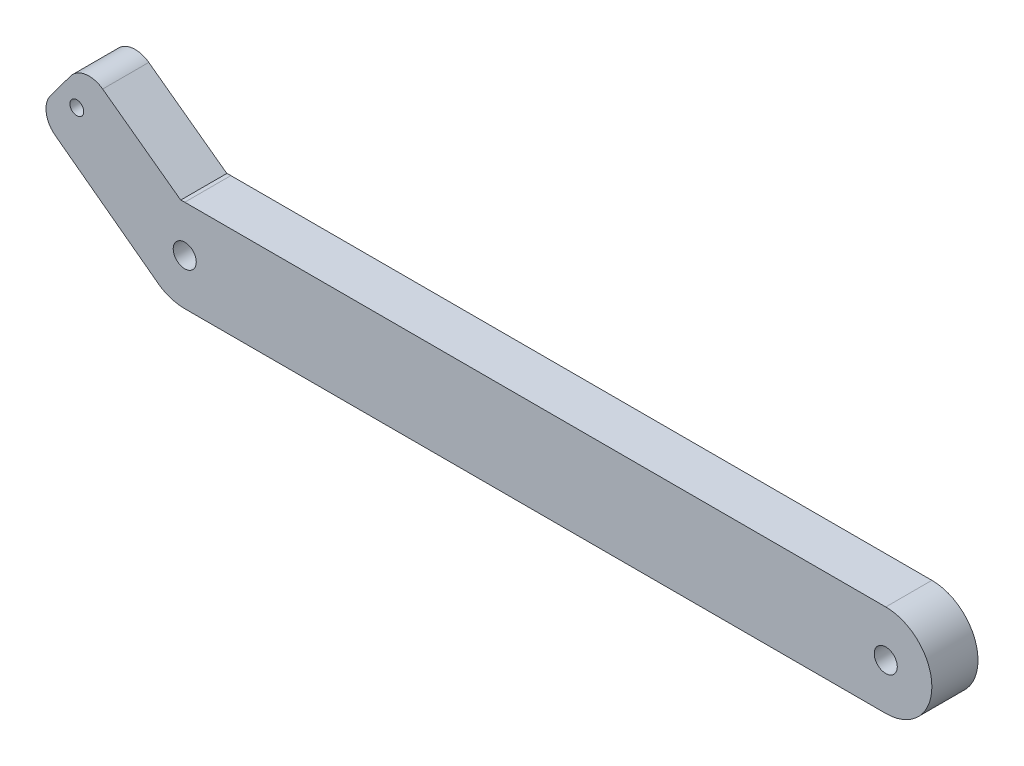
ISO-10303-21;
HEADER;
FILE_DESCRIPTION(('STEP AP214'),'2;1');
FILE_NAME('part.step','',(''),(''),'','','');
FILE_SCHEMA(('AUTOMOTIVE_DESIGN { 1 0 10303 214 1 1 1 1 }'));
ENDSEC;
DATA;
#1=APPLICATION_CONTEXT('core data for automotive mechanical design processes');
#2=APPLICATION_PROTOCOL_DEFINITION('international standard','automotive_design',2000,#1);
#3=PRODUCT_CONTEXT('',#1,'mechanical');
#4=PRODUCT('Part','Part','',(#3));
#5=PRODUCT_RELATED_PRODUCT_CATEGORY('part','',(#4));
#6=PRODUCT_DEFINITION_FORMATION('','',#4);
#7=PRODUCT_DEFINITION_CONTEXT('part definition',#1,'design');
#8=PRODUCT_DEFINITION('design','',#6,#7);
#9=PRODUCT_DEFINITION_SHAPE('','',#8);
#10=(LENGTH_UNIT() NAMED_UNIT(*) SI_UNIT(.MILLI.,.METRE.));
#11=(NAMED_UNIT(*) PLANE_ANGLE_UNIT() SI_UNIT($,.RADIAN.));
#12=(NAMED_UNIT(*) SI_UNIT($,.STERADIAN.) SOLID_ANGLE_UNIT());
#13=UNCERTAINTY_MEASURE_WITH_UNIT(LENGTH_MEASURE(1.E-05),#10,'distance_accuracy_value','');
#14=(GEOMETRIC_REPRESENTATION_CONTEXT(3) GLOBAL_UNCERTAINTY_ASSIGNED_CONTEXT((#13)) GLOBAL_UNIT_ASSIGNED_CONTEXT((#10,
#11,#12)) REPRESENTATION_CONTEXT('',''));
#15=CARTESIAN_POINT('',(0.,0.,0.));
#16=DIRECTION('',(0.,0.,1.));
#17=DIRECTION('',(1.,0.,0.));
#18=AXIS2_PLACEMENT_3D('',#15,#16,#17);
#19=CARTESIAN_POINT('',(0.,10.0000000000007,-10.));
#20=DIRECTION('',(0.,0.,1.));
#21=DIRECTION('',(-1.,0.,0.));
#22=AXIS2_PLACEMENT_3D('',#19,#20,#21);
#23=PLANE('',#22);
#24=CARTESIAN_POINT('',(0.,10.0000000000007,-10.));
#25=DIRECTION('',(0.,0.,1.));
#26=DIRECTION('',(-1.,0.,0.));
#27=AXIS2_PLACEMENT_3D('',#24,#25,#26);
#28=CIRCLE('',#27,10.0000000000007);
#29=CARTESIAN_POINT('',(-5.30568368334004,1.52357854679586,-10.));
#30=VERTEX_POINT('',#29);
#31=CARTESIAN_POINT('',(0.,0.,-10.));
#32=VERTEX_POINT('',#31);
#33=EDGE_CURVE('E171',#30,#32,#28,.T.);
#34=ORIENTED_EDGE('',*,*,#33,.F.);
#35=DIRECTION('',(0.801896547221452,-0.59746290893604,0.));
#36=VECTOR('',#35,1.);
#37=CARTESIAN_POINT('',(-5.30568368334004,1.52357854679586,-10.));
#38=LINE('',#37,#36);
#39=CARTESIAN_POINT('',(-28.075920727411,18.4888243863652,-10.));
#40=VERTEX_POINT('',#39);
#41=EDGE_CURVE('E139',#40,#30,#38,.T.);
#42=ORIENTED_EDGE('',*,*,#41,.F.);
#43=CARTESIAN_POINT('',(-25.0886061827308,22.4983071224725,-10.));
#44=DIRECTION('',(0.,0.,1.));
#45=DIRECTION('',(1.,0.,0.));
#46=AXIS2_PLACEMENT_3D('',#43,#44,#45);
#47=CIRCLE('',#46,5.);
#48=CARTESIAN_POINT('',(-29.098088918838,25.4856216671527,-10.));
#49=VERTEX_POINT('',#48);
#50=EDGE_CURVE('E120',#49,#40,#47,.T.);
#51=ORIENTED_EDGE('',*,*,#50,.F.);
#52=DIRECTION('',(-0.59746290893604,-0.801896547221452,0.));
#53=VECTOR('',#52,1.);
#54=CARTESIAN_POINT('',(-29.098088918838,25.4856216671527,-10.));
#55=LINE('',#54,#53);
#56=CARTESIAN_POINT('',(-24.7625453028706,31.3046564624064,-10.));
#57=VERTEX_POINT('',#56);
#58=EDGE_CURVE('E130',#57,#49,#55,.T.);
#59=ORIENTED_EDGE('',*,*,#58,.F.);
#60=CARTESIAN_POINT('',(-20.7530625667633,28.3173419177262,-10.));
#61=DIRECTION('',(0.,0.,1.));
#62=DIRECTION('',(1.,0.,0.));
#63=AXIS2_PLACEMENT_3D('',#60,#61,#62);
#64=CIRCLE('',#63,5.);
#65=CARTESIAN_POINT('',(-17.7993268257786,32.3516256425564,-10.));
#66=VERTEX_POINT('',#65);
#67=EDGE_CURVE('E135',#66,#57,#64,.T.);
#68=ORIENTED_EDGE('',*,*,#67,.F.);
#69=DIRECTION('',(-0.806856744966036,0.590747148196936,0.));
#70=VECTOR('',#69,1.);
#71=CARTESIAN_POINT('',(-17.7993268257786,32.3516256425564,-10.));
#72=LINE('',#71,#70);
#73=CARTESIAN_POINT('',(-0.876599726412103,19.961504551003,-10.));
#74=VERTEX_POINT('',#73);
#75=EDGE_CURVE('E207',#74,#66,#72,.T.);
#76=ORIENTED_EDGE('',*,*,#75,.F.);
#77=CARTESIAN_POINT('',(0.,10.0000000000007,-10.));
#78=DIRECTION('',(0.,0.,1.));
#79=DIRECTION('',(1.,0.,0.));
#80=AXIS2_PLACEMENT_3D('',#77,#78,#79);
#81=CIRCLE('',#80,9.99999999999928);
#82=CARTESIAN_POINT('',(0.,20.,-10.));
#83=VERTEX_POINT('',#82);
#84=EDGE_CURVE('E204',#83,#74,#81,.T.);
#85=ORIENTED_EDGE('',*,*,#84,.F.);
#86=DIRECTION('',(-1.,0.,0.));
#87=VECTOR('',#86,1.);
#88=CARTESIAN_POINT('',(0.,20.,-10.));
#89=LINE('',#88,#87);
#90=CARTESIAN_POINT('',(152.,20.,-10.));
#91=VERTEX_POINT('',#90);
#92=EDGE_CURVE('E201',#91,#83,#89,.T.);
#93=ORIENTED_EDGE('',*,*,#92,.F.);
#94=CARTESIAN_POINT('',(152.,10.,-10.));
#95=DIRECTION('',(0.,0.,1.));
#96=DIRECTION('',(-1.,0.,0.));
#97=AXIS2_PLACEMENT_3D('',#94,#95,#96);
#98=CIRCLE('',#97,10.);
#99=CARTESIAN_POINT('',(152.,0.,-10.));
#100=VERTEX_POINT('',#99);
#101=EDGE_CURVE('E194',#100,#91,#98,.T.);
#102=ORIENTED_EDGE('',*,*,#101,.F.);
#103=DIRECTION('',(1.,0.,0.));
#104=VECTOR('',#103,1.);
#105=CARTESIAN_POINT('',(0.,0.,-10.));
#106=LINE('',#105,#104);
#107=EDGE_CURVE('E184',#32,#100,#106,.T.);
#108=ORIENTED_EDGE('',*,*,#107,.F.);
#109=EDGE_LOOP('',(#34,#42,#51,#59,#68,#76,#85,#93,#102,#108));
#110=FACE_BOUND('',#109,.T.);
#111=CARTESIAN_POINT('',(0.,10.0000000000007,-10.));
#112=DIRECTION('',(0.,0.,1.));
#113=DIRECTION('',(1.,0.,0.));
#114=AXIS2_PLACEMENT_3D('',#111,#112,#113);
#115=CIRCLE('',#114,2.49999999999979);
#116=CARTESIAN_POINT('',(2.49999999999979,10.0000000000007,-10.));
#117=VERTEX_POINT('',#116);
#118=EDGE_CURVE('E148',#117,#117,#115,.T.);
#119=ORIENTED_EDGE('',*,*,#118,.T.);
#120=EDGE_LOOP('',(#119));
#121=FACE_BOUND('',#120,.T.);
#122=CARTESIAN_POINT('',(152.,10.,-10.));
#123=DIRECTION('',(0.,0.,1.));
#124=DIRECTION('',(1.,0.,0.));
#125=AXIS2_PLACEMENT_3D('',#122,#123,#124);
#126=CIRCLE('',#125,2.5);
#127=CARTESIAN_POINT('',(154.5,10.,-10.));
#128=VERTEX_POINT('',#127);
#129=EDGE_CURVE('E361',#128,#128,#126,.T.);
#130=ORIENTED_EDGE('',*,*,#129,.T.);
#131=EDGE_LOOP('',(#130));
#132=FACE_BOUND('',#131,.T.);
#133=CARTESIAN_POINT('',(-23.4097551919063,26.035431675397,-10.));
#134=DIRECTION('',(0.,0.,1.));
#135=DIRECTION('',(1.,0.,0.));
#136=AXIS2_PLACEMENT_3D('',#133,#134,#135);
#137=CIRCLE('',#136,1.5);
#138=CARTESIAN_POINT('',(-21.9097551919063,26.035431675397,-10.));
#139=VERTEX_POINT('',#138);
#140=EDGE_CURVE('E352',#139,#139,#137,.T.);
#141=ORIENTED_EDGE('',*,*,#140,.T.);
#142=EDGE_LOOP('',(#141));
#143=FACE_BOUND('',#142,.T.);
#144=ADVANCED_FACE('F35',(#110,#121,#132,#143),#23,.F.);
#145=CARTESIAN_POINT('',(0.,10.0000000000007,0.));
#146=DIRECTION('',(0.,0.,1.));
#147=DIRECTION('',(-1.,0.,0.));
#148=AXIS2_PLACEMENT_3D('',#145,#146,#147);
#149=PLANE('',#148);
#150=CARTESIAN_POINT('',(152.,10.,0.));
#151=DIRECTION('',(0.,0.,1.));
#152=DIRECTION('',(1.,0.,0.));
#153=AXIS2_PLACEMENT_3D('',#150,#151,#152);
#154=CIRCLE('',#153,2.5);
#155=CARTESIAN_POINT('',(154.5,10.,0.));
#156=VERTEX_POINT('',#155);
#157=EDGE_CURVE('E358',#156,#156,#154,.T.);
#158=ORIENTED_EDGE('',*,*,#157,.F.);
#159=EDGE_LOOP('',(#158));
#160=FACE_BOUND('',#159,.T.);
#161=CARTESIAN_POINT('',(0.,10.0000000000007,0.));
#162=DIRECTION('',(0.,0.,1.));
#163=DIRECTION('',(-1.,0.,0.));
#164=AXIS2_PLACEMENT_3D('',#161,#162,#163);
#165=CIRCLE('',#164,10.0000000000007);
#166=CARTESIAN_POINT('',(-5.30568368334004,1.52357854679586,0.));
#167=VERTEX_POINT('',#166);
#168=CARTESIAN_POINT('',(0.,0.,0.));
#169=VERTEX_POINT('',#168);
#170=EDGE_CURVE('E144',#167,#169,#165,.T.);
#171=ORIENTED_EDGE('',*,*,#170,.T.);
#172=DIRECTION('',(1.,0.,0.));
#173=VECTOR('',#172,1.);
#174=CARTESIAN_POINT('',(0.,0.,0.));
#175=LINE('',#174,#173);
#176=CARTESIAN_POINT('',(152.,0.,0.));
#177=VERTEX_POINT('',#176);
#178=EDGE_CURVE('E147',#169,#177,#175,.T.);
#179=ORIENTED_EDGE('',*,*,#178,.T.);
#180=CARTESIAN_POINT('',(152.,10.,0.));
#181=DIRECTION('',(0.,0.,1.));
#182=DIRECTION('',(-1.,0.,0.));
#183=AXIS2_PLACEMENT_3D('',#180,#181,#182);
#184=CIRCLE('',#183,10.);
#185=CARTESIAN_POINT('',(152.,20.,0.));
#186=VERTEX_POINT('',#185);
#187=EDGE_CURVE('E151',#177,#186,#184,.T.);
#188=ORIENTED_EDGE('',*,*,#187,.T.);
#189=DIRECTION('',(-1.,0.,0.));
#190=VECTOR('',#189,1.);
#191=CARTESIAN_POINT('',(0.,20.,0.));
#192=LINE('',#191,#190);
#193=CARTESIAN_POINT('',(0.,20.,0.));
#194=VERTEX_POINT('',#193);
#195=EDGE_CURVE('E154',#186,#194,#192,.T.);
#196=ORIENTED_EDGE('',*,*,#195,.T.);
#197=CARTESIAN_POINT('',(0.,10.0000000000007,0.));
#198=DIRECTION('',(0.,0.,1.));
#199=DIRECTION('',(1.,0.,0.));
#200=AXIS2_PLACEMENT_3D('',#197,#198,#199);
#201=CIRCLE('',#200,9.99999999999928);
#202=CARTESIAN_POINT('',(-0.876599726412103,19.961504551003,0.));
#203=VERTEX_POINT('',#202);
#204=EDGE_CURVE('E157',#194,#203,#201,.T.);
#205=ORIENTED_EDGE('',*,*,#204,.T.);
#206=DIRECTION('',(-0.806856744966036,0.590747148196936,0.));
#207=VECTOR('',#206,1.);
#208=CARTESIAN_POINT('',(-17.7993268257786,32.3516256425564,0.));
#209=LINE('',#208,#207);
#210=CARTESIAN_POINT('',(-17.7993268257786,32.3516256425564,0.));
#211=VERTEX_POINT('',#210);
#212=EDGE_CURVE('E160',#203,#211,#209,.T.);
#213=ORIENTED_EDGE('',*,*,#212,.T.);
#214=CARTESIAN_POINT('',(-20.7530625667633,28.3173419177262,0.));
#215=DIRECTION('',(0.,0.,1.));
#216=DIRECTION('',(1.,0.,0.));
#217=AXIS2_PLACEMENT_3D('',#214,#215,#216);
#218=CIRCLE('',#217,5.);
#219=CARTESIAN_POINT('',(-24.7625453028706,31.3046564624064,0.));
#220=VERTEX_POINT('',#219);
#221=EDGE_CURVE('E163',#211,#220,#218,.T.);
#222=ORIENTED_EDGE('',*,*,#221,.T.);
#223=DIRECTION('',(-0.59746290893604,-0.801896547221452,0.));
#224=VECTOR('',#223,1.);
#225=CARTESIAN_POINT('',(-29.098088918838,25.4856216671527,0.));
#226=LINE('',#225,#224);
#227=CARTESIAN_POINT('',(-29.098088918838,25.4856216671527,0.));
#228=VERTEX_POINT('',#227);
#229=EDGE_CURVE('E166',#220,#228,#226,.T.);
#230=ORIENTED_EDGE('',*,*,#229,.T.);
#231=CARTESIAN_POINT('',(-25.0886061827308,22.4983071224725,0.));
#232=DIRECTION('',(0.,0.,1.));
#233=DIRECTION('',(1.,0.,0.));
#234=AXIS2_PLACEMENT_3D('',#231,#232,#233);
#235=CIRCLE('',#234,5.);
#236=CARTESIAN_POINT('',(-28.075920727411,18.4888243863652,0.));
#237=VERTEX_POINT('',#236);
#238=EDGE_CURVE('E123',#228,#237,#235,.T.);
#239=ORIENTED_EDGE('',*,*,#238,.T.);
#240=DIRECTION('',(0.801896547221452,-0.59746290893604,0.));
#241=VECTOR('',#240,1.);
#242=CARTESIAN_POINT('',(-5.30568368334004,1.52357854679586,0.));
#243=LINE('',#242,#241);
#244=EDGE_CURVE('E169',#237,#167,#243,.T.);
#245=ORIENTED_EDGE('',*,*,#244,.T.);
#246=EDGE_LOOP('',(#171,#179,#188,#196,#205,#213,#222,#230,#239,#245));
#247=FACE_BOUND('',#246,.T.);
#248=CARTESIAN_POINT('',(0.,10.0000000000007,0.));
#249=DIRECTION('',(0.,0.,1.));
#250=DIRECTION('',(1.,0.,0.));
#251=AXIS2_PLACEMENT_3D('',#248,#249,#250);
#252=CIRCLE('',#251,2.49999999999979);
#253=CARTESIAN_POINT('',(2.49999999999979,10.0000000000007,0.));
#254=VERTEX_POINT('',#253);
#255=EDGE_CURVE('E197',#254,#254,#252,.T.);
#256=ORIENTED_EDGE('',*,*,#255,.F.);
#257=EDGE_LOOP('',(#256));
#258=FACE_BOUND('',#257,.T.);
#259=CARTESIAN_POINT('',(-23.4097551919063,26.035431675397,0.));
#260=DIRECTION('',(0.,0.,1.));
#261=DIRECTION('',(1.,0.,0.));
#262=AXIS2_PLACEMENT_3D('',#259,#260,#261);
#263=CIRCLE('',#262,1.5);
#264=CARTESIAN_POINT('',(-21.9097551919063,26.035431675397,0.));
#265=VERTEX_POINT('',#264);
#266=EDGE_CURVE('E355',#265,#265,#263,.T.);
#267=ORIENTED_EDGE('',*,*,#266,.F.);
#268=EDGE_LOOP('',(#267));
#269=FACE_BOUND('',#268,.T.);
#270=ADVANCED_FACE('F191',(#160,#247,#258,#269),#149,.T.);
#271=CARTESIAN_POINT('',(0.,10.0000000000007,-10.));
#272=DIRECTION('',(0.,0.,1.));
#273=DIRECTION('',(-1.,0.,0.));
#274=AXIS2_PLACEMENT_3D('',#271,#272,#273);
#275=CYLINDRICAL_SURFACE('',#274,10.0000000000007);
#276=ORIENTED_EDGE('',*,*,#170,.F.);
#277=DIRECTION('',(0.,0.,1.));
#278=VECTOR('',#277,1.);
#279=CARTESIAN_POINT('',(-5.30568368334004,1.52357854679586,-10.));
#280=LINE('',#279,#278);
#281=EDGE_CURVE('E52',#30,#167,#280,.T.);
#282=ORIENTED_EDGE('',*,*,#281,.F.);
#283=ORIENTED_EDGE('',*,*,#33,.T.);
#284=DIRECTION('',(0.,0.,1.));
#285=VECTOR('',#284,1.);
#286=CARTESIAN_POINT('',(0.,0.,-10.));
#287=LINE('',#286,#285);
#288=EDGE_CURVE('E11',#32,#169,#287,.T.);
#289=ORIENTED_EDGE('',*,*,#288,.T.);
#290=EDGE_LOOP('',(#276,#282,#283,#289));
#291=FACE_BOUND('',#290,.T.);
#292=ADVANCED_FACE('F37',(#291),#275,.T.);
#293=CARTESIAN_POINT('',(0.,0.,-10.));
#294=DIRECTION('',(0.,1.,0.));
#295=DIRECTION('',(0.,0.,-1.));
#296=AXIS2_PLACEMENT_3D('',#293,#294,#295);
#297=PLANE('',#296);
#298=ORIENTED_EDGE('',*,*,#178,.F.);
#299=ORIENTED_EDGE('',*,*,#288,.F.);
#300=ORIENTED_EDGE('',*,*,#107,.T.);
#301=DIRECTION('',(0.,0.,1.));
#302=VECTOR('',#301,1.);
#303=CARTESIAN_POINT('',(152.,0.,-10.));
#304=LINE('',#303,#302);
#305=EDGE_CURVE('E44',#100,#177,#304,.T.);
#306=ORIENTED_EDGE('',*,*,#305,.T.);
#307=EDGE_LOOP('',(#298,#299,#300,#306));
#308=FACE_BOUND('',#307,.T.);
#309=ADVANCED_FACE('F183',(#308),#297,.F.);
#310=CARTESIAN_POINT('',(152.,10.,-10.));
#311=DIRECTION('',(0.,0.,1.));
#312=DIRECTION('',(-1.,0.,0.));
#313=AXIS2_PLACEMENT_3D('',#310,#311,#312);
#314=CYLINDRICAL_SURFACE('',#313,10.);
#315=ORIENTED_EDGE('',*,*,#187,.F.);
#316=ORIENTED_EDGE('',*,*,#305,.F.);
#317=ORIENTED_EDGE('',*,*,#101,.T.);
#318=DIRECTION('',(0.,0.,1.));
#319=VECTOR('',#318,1.);
#320=CARTESIAN_POINT('',(152.,20.,-10.));
#321=LINE('',#320,#319);
#322=EDGE_CURVE('E181',#91,#186,#321,.T.);
#323=ORIENTED_EDGE('',*,*,#322,.T.);
#324=EDGE_LOOP('',(#315,#316,#317,#323));
#325=FACE_BOUND('',#324,.T.);
#326=ADVANCED_FACE('F188',(#325),#314,.T.);
#327=CARTESIAN_POINT('',(0.,20.,-10.));
#328=DIRECTION('',(0.,-1.,0.));
#329=DIRECTION('',(1.,0.,0.));
#330=AXIS2_PLACEMENT_3D('',#327,#328,#329);
#331=PLANE('',#330);
#332=ORIENTED_EDGE('',*,*,#195,.F.);
#333=ORIENTED_EDGE('',*,*,#322,.F.);
#334=ORIENTED_EDGE('',*,*,#92,.T.);
#335=DIRECTION('',(0.,0.,1.));
#336=VECTOR('',#335,1.);
#337=CARTESIAN_POINT('',(0.,20.,-10.));
#338=LINE('',#337,#336);
#339=EDGE_CURVE('E179',#83,#194,#338,.T.);
#340=ORIENTED_EDGE('',*,*,#339,.T.);
#341=EDGE_LOOP('',(#332,#333,#334,#340));
#342=FACE_BOUND('',#341,.T.);
#343=ADVANCED_FACE('F222',(#342),#331,.F.);
#344=CARTESIAN_POINT('',(0.,10.0000000000007,-10.));
#345=DIRECTION('',(0.,0.,1.));
#346=DIRECTION('',(-1.,0.,0.));
#347=AXIS2_PLACEMENT_3D('',#344,#345,#346);
#348=CYLINDRICAL_SURFACE('',#347,9.99999999999928);
#349=ORIENTED_EDGE('',*,*,#204,.F.);
#350=ORIENTED_EDGE('',*,*,#339,.F.);
#351=ORIENTED_EDGE('',*,*,#84,.T.);
#352=DIRECTION('',(0.,0.,1.));
#353=VECTOR('',#352,1.);
#354=CARTESIAN_POINT('',(-0.876599726412103,19.961504551003,-10.));
#355=LINE('',#354,#353);
#356=EDGE_CURVE('E177',#74,#203,#355,.T.);
#357=ORIENTED_EDGE('',*,*,#356,.T.);
#358=EDGE_LOOP('',(#349,#350,#351,#357));
#359=FACE_BOUND('',#358,.T.);
#360=ADVANCED_FACE('F220',(#359),#348,.T.);
#361=CARTESIAN_POINT('',(-17.7993268257786,32.3516256425564,-10.));
#362=DIRECTION('',(-0.590747148196936,-0.806856744966036,0.));
#363=DIRECTION('',(0.806856744966036,-0.590747148196936,0.));
#364=AXIS2_PLACEMENT_3D('',#361,#362,#363);
#365=PLANE('',#364);
#366=ORIENTED_EDGE('',*,*,#212,.F.);
#367=ORIENTED_EDGE('',*,*,#356,.F.);
#368=ORIENTED_EDGE('',*,*,#75,.T.);
#369=DIRECTION('',(0.,0.,1.));
#370=VECTOR('',#369,1.);
#371=CARTESIAN_POINT('',(-17.7993268257786,32.3516256425564,-10.));
#372=LINE('',#371,#370);
#373=EDGE_CURVE('E175',#66,#211,#372,.T.);
#374=ORIENTED_EDGE('',*,*,#373,.T.);
#375=EDGE_LOOP('',(#366,#367,#368,#374));
#376=FACE_BOUND('',#375,.T.);
#377=ADVANCED_FACE('F217',(#376),#365,.F.);
#378=CARTESIAN_POINT('',(-20.7530625667633,28.3173419177262,-10.));
#379=DIRECTION('',(0.,0.,1.));
#380=DIRECTION('',(-1.,0.,0.));
#381=AXIS2_PLACEMENT_3D('',#378,#379,#380);
#382=CYLINDRICAL_SURFACE('',#381,5.);
#383=ORIENTED_EDGE('',*,*,#221,.F.);
#384=ORIENTED_EDGE('',*,*,#373,.F.);
#385=ORIENTED_EDGE('',*,*,#67,.T.);
#386=DIRECTION('',(0.,0.,1.));
#387=VECTOR('',#386,1.);
#388=CARTESIAN_POINT('',(-24.7625453028706,31.3046564624064,-10.));
#389=LINE('',#388,#387);
#390=EDGE_CURVE('E127',#57,#220,#389,.T.);
#391=ORIENTED_EDGE('',*,*,#390,.T.);
#392=EDGE_LOOP('',(#383,#384,#385,#391));
#393=FACE_BOUND('',#392,.T.);
#394=ADVANCED_FACE('F211',(#393),#382,.T.);
#395=CARTESIAN_POINT('',(-29.098088918838,25.4856216671527,-10.));
#396=DIRECTION('',(0.801896547221452,-0.59746290893604,0.));
#397=DIRECTION('',(0.59746290893604,0.801896547221452,0.));
#398=AXIS2_PLACEMENT_3D('',#395,#396,#397);
#399=PLANE('',#398);
#400=ORIENTED_EDGE('',*,*,#229,.F.);
#401=ORIENTED_EDGE('',*,*,#390,.F.);
#402=ORIENTED_EDGE('',*,*,#58,.T.);
#403=DIRECTION('',(0.,0.,1.));
#404=VECTOR('',#403,1.);
#405=CARTESIAN_POINT('',(-29.098088918838,25.4856216671527,-10.));
#406=LINE('',#405,#404);
#407=EDGE_CURVE('E116',#49,#228,#406,.T.);
#408=ORIENTED_EDGE('',*,*,#407,.T.);
#409=EDGE_LOOP('',(#400,#401,#402,#408));
#410=FACE_BOUND('',#409,.T.);
#411=ADVANCED_FACE('F131',(#410),#399,.F.);
#412=CARTESIAN_POINT('',(-25.0886061827308,22.4983071224725,-10.));
#413=DIRECTION('',(0.,0.,1.));
#414=DIRECTION('',(-1.,0.,0.));
#415=AXIS2_PLACEMENT_3D('',#412,#413,#414);
#416=CYLINDRICAL_SURFACE('',#415,5.);
#417=ORIENTED_EDGE('',*,*,#238,.F.);
#418=ORIENTED_EDGE('',*,*,#407,.F.);
#419=ORIENTED_EDGE('',*,*,#50,.T.);
#420=DIRECTION('',(0.,0.,1.));
#421=VECTOR('',#420,1.);
#422=CARTESIAN_POINT('',(-28.075920727411,18.4888243863652,-10.));
#423=LINE('',#422,#421);
#424=EDGE_CURVE('E86',#40,#237,#423,.T.);
#425=ORIENTED_EDGE('',*,*,#424,.T.);
#426=EDGE_LOOP('',(#417,#418,#419,#425));
#427=FACE_BOUND('',#426,.T.);
#428=ADVANCED_FACE('F118',(#427),#416,.T.);
#429=CARTESIAN_POINT('',(-5.30568368334004,1.52357854679586,-10.));
#430=DIRECTION('',(0.59746290893604,0.801896547221452,0.));
#431=DIRECTION('',(-0.801896547221452,0.59746290893604,0.));
#432=AXIS2_PLACEMENT_3D('',#429,#430,#431);
#433=PLANE('',#432);
#434=ORIENTED_EDGE('',*,*,#244,.F.);
#435=ORIENTED_EDGE('',*,*,#424,.F.);
#436=ORIENTED_EDGE('',*,*,#41,.T.);
#437=ORIENTED_EDGE('',*,*,#281,.T.);
#438=EDGE_LOOP('',(#434,#435,#436,#437));
#439=FACE_BOUND('',#438,.T.);
#440=ADVANCED_FACE('F242',(#439),#433,.F.);
#441=CARTESIAN_POINT('',(0.,10.0000000000007,-10.));
#442=DIRECTION('',(0.,0.,1.));
#443=DIRECTION('',(-1.,0.,0.));
#444=AXIS2_PLACEMENT_3D('',#441,#442,#443);
#445=CYLINDRICAL_SURFACE('',#444,2.49999999999979);
#446=ORIENTED_EDGE('',*,*,#118,.F.);
#447=EDGE_LOOP('',(#446));
#448=FACE_BOUND('',#447,.T.);
#449=ORIENTED_EDGE('',*,*,#255,.T.);
#450=EDGE_LOOP('',(#449));
#451=FACE_BOUND('',#450,.T.);
#452=ADVANCED_FACE('F239',(#448,#451),#445,.F.);
#453=CARTESIAN_POINT('',(152.,10.,-10.));
#454=DIRECTION('',(0.,0.,1.));
#455=DIRECTION('',(-1.,0.,0.));
#456=AXIS2_PLACEMENT_3D('',#453,#454,#455);
#457=CYLINDRICAL_SURFACE('',#456,2.5);
#458=ORIENTED_EDGE('',*,*,#129,.F.);
#459=EDGE_LOOP('',(#458));
#460=FACE_BOUND('',#459,.T.);
#461=ORIENTED_EDGE('',*,*,#157,.T.);
#462=EDGE_LOOP('',(#461));
#463=FACE_BOUND('',#462,.T.);
#464=ADVANCED_FACE('F278',(#460,#463),#457,.F.);
#465=CARTESIAN_POINT('',(-23.4097551919063,26.035431675397,-10.));
#466=DIRECTION('',(0.,0.,1.));
#467=DIRECTION('',(-1.,0.,0.));
#468=AXIS2_PLACEMENT_3D('',#465,#466,#467);
#469=CYLINDRICAL_SURFACE('',#468,1.5);
#470=ORIENTED_EDGE('',*,*,#140,.F.);
#471=EDGE_LOOP('',(#470));
#472=FACE_BOUND('',#471,.T.);
#473=ORIENTED_EDGE('',*,*,#266,.T.);
#474=EDGE_LOOP('',(#473));
#475=FACE_BOUND('',#474,.T.);
#476=ADVANCED_FACE('F285',(#472,#475),#469,.F.);
#477=CLOSED_SHELL('',(#144,#270,#292,#309,#326,#343,#360,#377,#394,#411,#428,#440,#452,#464,#476));
#478=MANIFOLD_SOLID_BREP('B2',#477);
#479=ADVANCED_BREP_SHAPE_REPRESENTATION('',(#18,#478),#14);
#480=SHAPE_DEFINITION_REPRESENTATION(#9,#479);
ENDSEC;
END-ISO-10303-21;
